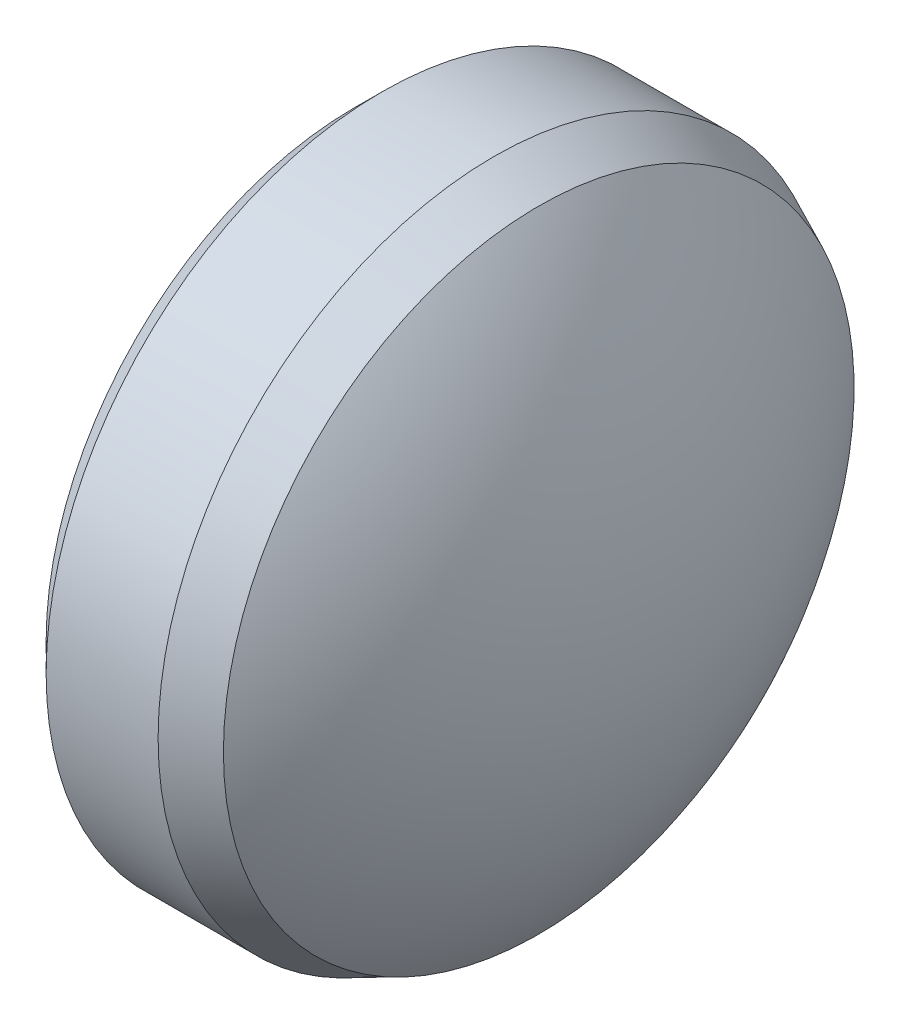
ISO-10303-21;
HEADER;
FILE_DESCRIPTION(('STEP AP214'),'2;1');
FILE_NAME('part.step','',(''),(''),'','','');
FILE_SCHEMA(('AUTOMOTIVE_DESIGN { 1 0 10303 214 1 1 1 1 }'));
ENDSEC;
DATA;
#1=APPLICATION_CONTEXT('core data for automotive mechanical design processes');
#2=APPLICATION_PROTOCOL_DEFINITION('international standard','automotive_design',2000,#1);
#3=PRODUCT_CONTEXT('',#1,'mechanical');
#4=PRODUCT('Part','Part','',(#3));
#5=PRODUCT_RELATED_PRODUCT_CATEGORY('part','',(#4));
#6=PRODUCT_DEFINITION_FORMATION('','',#4);
#7=PRODUCT_DEFINITION_CONTEXT('part definition',#1,'design');
#8=PRODUCT_DEFINITION('design','',#6,#7);
#9=PRODUCT_DEFINITION_SHAPE('','',#8);
#10=(LENGTH_UNIT() NAMED_UNIT(*) SI_UNIT(.MILLI.,.METRE.));
#11=(NAMED_UNIT(*) PLANE_ANGLE_UNIT() SI_UNIT($,.RADIAN.));
#12=(NAMED_UNIT(*) SI_UNIT($,.STERADIAN.) SOLID_ANGLE_UNIT());
#13=UNCERTAINTY_MEASURE_WITH_UNIT(LENGTH_MEASURE(1.E-05),#10,'distance_accuracy_value','');
#14=(GEOMETRIC_REPRESENTATION_CONTEXT(3) GLOBAL_UNCERTAINTY_ASSIGNED_CONTEXT((#13)) GLOBAL_UNIT_ASSIGNED_CONTEXT((#10,
#11,#12)) REPRESENTATION_CONTEXT('',''));
#15=CARTESIAN_POINT('',(0.,0.,0.));
#16=DIRECTION('',(0.,0.,1.));
#17=DIRECTION('',(1.,0.,0.));
#18=AXIS2_PLACEMENT_3D('',#15,#16,#17);
#19=CARTESIAN_POINT('',(-1.3,0.,0.));
#20=DIRECTION('',(1.,0.,0.));
#21=DIRECTION('',(0.,0.,-1.));
#22=AXIS2_PLACEMENT_3D('',#19,#20,#21);
#23=PLANE('',#22);
#24=CARTESIAN_POINT('',(-1.3,0.,0.));
#25=DIRECTION('',(1.,0.,0.));
#26=DIRECTION('',(0.,0.,-1.));
#27=AXIS2_PLACEMENT_3D('',#24,#25,#26);
#28=CIRCLE('',#27,2.75);
#29=CARTESIAN_POINT('',(-1.3,0.,-2.75));
#30=VERTEX_POINT('',#29);
#31=EDGE_CURVE('E10',#30,#30,#28,.F.);
#32=ORIENTED_EDGE('',*,*,#31,.T.);
#33=EDGE_LOOP('',(#32));
#34=FACE_BOUND('',#33,.T.);
#35=ADVANCED_FACE('F15',(#34),#23,.F.);
#36=CARTESIAN_POINT('',(-1.3,0.,0.));
#37=DIRECTION('',(-1.,0.,0.));
#38=DIRECTION('',(0.,0.,1.));
#39=AXIS2_PLACEMENT_3D('',#36,#37,#38);
#40=CYLINDRICAL_SURFACE('',#39,3.);
#41=CARTESIAN_POINT('',(-0.0500000000000023,0.,0.));
#42=DIRECTION('',(-1.,0.,0.));
#43=DIRECTION('',(0.,0.,1.));
#44=AXIS2_PLACEMENT_3D('',#41,#42,#43);
#45=CIRCLE('',#44,3.);
#46=CARTESIAN_POINT('',(-0.0500000000000023,0.,3.));
#47=VERTEX_POINT('',#46);
#48=EDGE_CURVE('E55',#47,#47,#45,.T.);
#49=ORIENTED_EDGE('',*,*,#48,.T.);
#50=EDGE_LOOP('',(#49));
#51=FACE_BOUND('',#50,.T.);
#52=CARTESIAN_POINT('',(-1.05,0.,0.));
#53=DIRECTION('',(1.,0.,0.));
#54=DIRECTION('',(0.,0.,-1.));
#55=AXIS2_PLACEMENT_3D('',#52,#53,#54);
#56=CIRCLE('',#55,3.);
#57=CARTESIAN_POINT('',(-1.05,0.,-3.));
#58=VERTEX_POINT('',#57);
#59=EDGE_CURVE('E53',#58,#58,#56,.T.);
#60=ORIENTED_EDGE('',*,*,#59,.T.);
#61=EDGE_LOOP('',(#60));
#62=FACE_BOUND('',#61,.T.);
#63=ADVANCED_FACE('F28',(#51,#62),#40,.T.);
#64=CARTESIAN_POINT('',(-3.29997551412774,0.,0.0150089781531611));
#65=DIRECTION('',(0.,-1.,0.));
#66=DIRECTION('',(0.,0.,1.));
#67=AXIS2_PLACEMENT_3D('',#64,#65,#66);
#68=CIRCLE('',#67,4.6);
#69=TRIMMED_CURVE('',#68,(PARAMETER_VALUE(-1.5740591539219)),(PARAMETER_VALUE(1.5740591539219)),
.T.,.PARAMETER.);
#70=CARTESIAN_POINT('',(-3.29997551412774,0.,0.));
#71=DIRECTION('',(-1.,0.,0.));
#72=AXIS1_PLACEMENT('',#70,#71);
#73=SURFACE_OF_REVOLUTION('',#69,#72);
#74=CARTESIAN_POINT('',(0.349011913019594,0.,0.));
#75=DIRECTION('',(-1.,0.,0.));
#76=DIRECTION('',(0.,0.,1.));
#77=AXIS2_PLACEMENT_3D('',#74,#75,#76);
#78=CIRCLE('',#77,2.8158821913709);
#79=CARTESIAN_POINT('',(0.349011913019594,0.,2.8158821913709));
#80=VERTEX_POINT('',#79);
#81=EDGE_CURVE('E22',#80,#80,#78,.F.);
#82=ORIENTED_EDGE('',*,*,#81,.T.);
#83=EDGE_LOOP('',(#82));
#84=FACE_BOUND('',#83,.T.);
#85=CARTESIAN_POINT('',(1.3,0.,0.));
#86=VERTEX_POINT('',#85);
#87=VERTEX_LOOP('',#86);
#88=FACE_BOUND('',#87,.T.);
#89=ADVANCED_FACE('F25',(#84,#88),#73,.T.);
#90=CARTESIAN_POINT('',(-0.0500000000000023,0.,0.));
#91=DIRECTION('',(-1.,0.,0.));
#92=DIRECTION('',(0.,0.,1.));
#93=AXIS2_PLACEMENT_3D('',#90,#91,#92);
#94=CONICAL_SURFACE('',#93,3.,0.432321955830396);
#95=ORIENTED_EDGE('',*,*,#81,.F.);
#96=EDGE_LOOP('',(#95));
#97=FACE_BOUND('',#96,.T.);
#98=ORIENTED_EDGE('',*,*,#48,.F.);
#99=EDGE_LOOP('',(#98));
#100=FACE_BOUND('',#99,.T.);
#101=ADVANCED_FACE('F27',(#97,#100),#94,.T.);
#102=CARTESIAN_POINT('',(-1.3,0.,0.));
#103=DIRECTION('',(1.,0.,0.));
#104=DIRECTION('',(0.,0.,-1.));
#105=AXIS2_PLACEMENT_3D('',#102,#103,#104);
#106=CONICAL_SURFACE('',#105,2.75,0.785398163397448);
#107=ORIENTED_EDGE('',*,*,#59,.F.);
#108=EDGE_LOOP('',(#107));
#109=FACE_BOUND('',#108,.T.);
#110=ORIENTED_EDGE('',*,*,#31,.F.);
#111=EDGE_LOOP('',(#110));
#112=FACE_BOUND('',#111,.T.);
#113=ADVANCED_FACE('F17',(#109,#112),#106,.T.);
#114=CLOSED_SHELL('',(#35,#63,#89,#101,#113));
#115=MANIFOLD_SOLID_BREP('B1',#114);
#116=ADVANCED_BREP_SHAPE_REPRESENTATION('',(#18,#115),#14);
#117=SHAPE_DEFINITION_REPRESENTATION(#9,#116);
ENDSEC;
END-ISO-10303-21;
